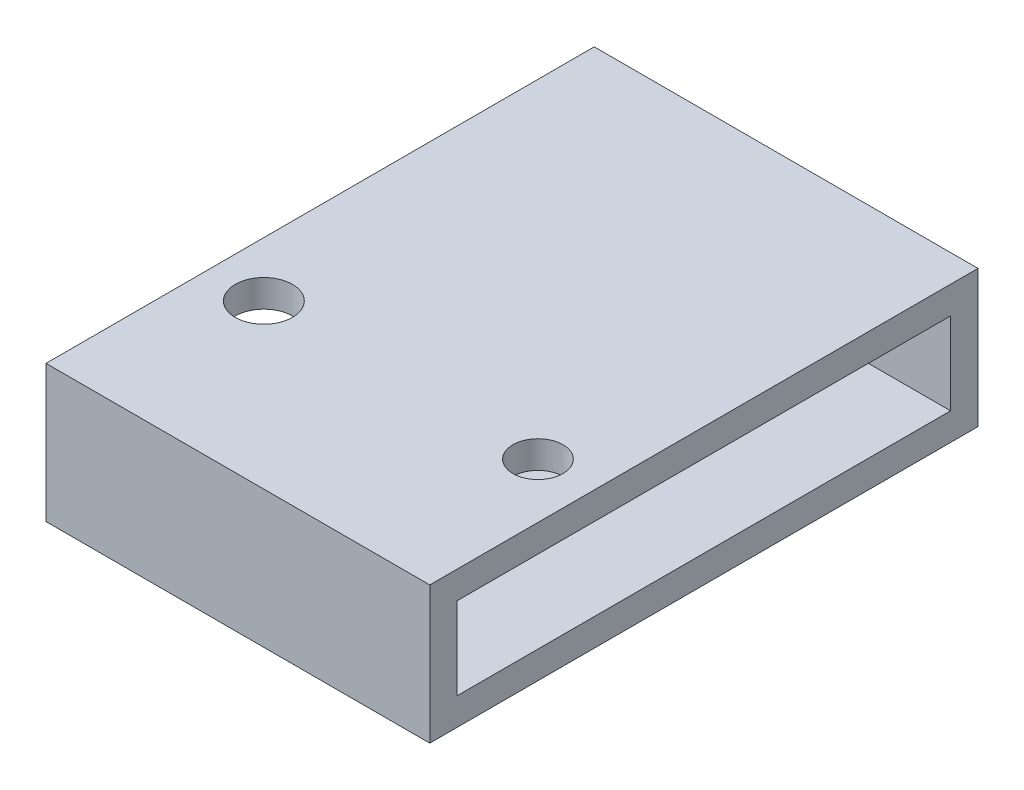
ISO-10303-21;
HEADER;
FILE_DESCRIPTION(('STEP AP214'),'2;1');
FILE_NAME('part.step','',(''),(''),'','','');
FILE_SCHEMA(('AUTOMOTIVE_DESIGN { 1 0 10303 214 1 1 1 1 }'));
ENDSEC;
DATA;
#1=APPLICATION_CONTEXT('core data for automotive mechanical design processes');
#2=APPLICATION_PROTOCOL_DEFINITION('international standard','automotive_design',2000,#1);
#3=PRODUCT_CONTEXT('',#1,'mechanical');
#4=PRODUCT('Part','Part','',(#3));
#5=PRODUCT_RELATED_PRODUCT_CATEGORY('part','',(#4));
#6=PRODUCT_DEFINITION_FORMATION('','',#4);
#7=PRODUCT_DEFINITION_CONTEXT('part definition',#1,'design');
#8=PRODUCT_DEFINITION('design','',#6,#7);
#9=PRODUCT_DEFINITION_SHAPE('','',#8);
#10=(LENGTH_UNIT() NAMED_UNIT(*) SI_UNIT(.MILLI.,.METRE.));
#11=(NAMED_UNIT(*) PLANE_ANGLE_UNIT() SI_UNIT($,.RADIAN.));
#12=(NAMED_UNIT(*) SI_UNIT($,.STERADIAN.) SOLID_ANGLE_UNIT());
#13=UNCERTAINTY_MEASURE_WITH_UNIT(LENGTH_MEASURE(1.E-05),#10,'distance_accuracy_value','');
#14=(GEOMETRIC_REPRESENTATION_CONTEXT(3) GLOBAL_UNCERTAINTY_ASSIGNED_CONTEXT((#13)) GLOBAL_UNIT_ASSIGNED_CONTEXT((#10,
#11,#12)) REPRESENTATION_CONTEXT('',''));
#15=CARTESIAN_POINT('',(0.,0.,0.));
#16=DIRECTION('',(0.,0.,1.));
#17=DIRECTION('',(1.,0.,0.));
#18=AXIS2_PLACEMENT_3D('',#15,#16,#17);
#19=CARTESIAN_POINT('',(0.,6.35,0.));
#20=DIRECTION('',(1.,0.,0.));
#21=DIRECTION('',(0.,0.,-1.));
#22=AXIS2_PLACEMENT_3D('',#19,#20,#21);
#23=PLANE('',#22);
#24=DIRECTION('',(0.,1.,0.));
#25=VECTOR('',#24,1.);
#26=CARTESIAN_POINT('',(0.,5.08,-1.27));
#27=LINE('',#26,#25);
#28=CARTESIAN_POINT('',(0.,1.27,-1.27));
#29=VERTEX_POINT('',#28);
#30=CARTESIAN_POINT('',(0.,5.08,-1.27));
#31=VERTEX_POINT('',#30);
#32=EDGE_CURVE('E55',#29,#31,#27,.T.);
#33=ORIENTED_EDGE('',*,*,#32,.F.);
#34=DIRECTION('',(0.,0.,1.));
#35=VECTOR('',#34,1.);
#36=CARTESIAN_POINT('',(0.,1.27,-1.27));
#37=LINE('',#36,#35);
#38=CARTESIAN_POINT('',(0.,1.27,-24.13));
#39=VERTEX_POINT('',#38);
#40=EDGE_CURVE('E109',#39,#29,#37,.T.);
#41=ORIENTED_EDGE('',*,*,#40,.F.);
#42=DIRECTION('',(0.,-1.,0.));
#43=VECTOR('',#42,1.);
#44=CARTESIAN_POINT('',(0.,1.27,-24.13));
#45=LINE('',#44,#43);
#46=CARTESIAN_POINT('',(0.,5.08,-24.13));
#47=VERTEX_POINT('',#46);
#48=EDGE_CURVE('E116',#47,#39,#45,.T.);
#49=ORIENTED_EDGE('',*,*,#48,.F.);
#50=DIRECTION('',(0.,0.,-1.));
#51=VECTOR('',#50,1.);
#52=CARTESIAN_POINT('',(0.,5.08,-24.13));
#53=LINE('',#52,#51);
#54=EDGE_CURVE('E127',#31,#47,#53,.T.);
#55=ORIENTED_EDGE('',*,*,#54,.F.);
#56=EDGE_LOOP('',(#33,#41,#49,#55));
#57=FACE_BOUND('',#56,.T.);
#58=DIRECTION('',(0.,0.,1.));
#59=VECTOR('',#58,1.);
#60=CARTESIAN_POINT('',(0.,0.,0.));
#61=LINE('',#60,#59);
#62=CARTESIAN_POINT('',(0.,0.,-25.4));
#63=VERTEX_POINT('',#62);
#64=CARTESIAN_POINT('',(0.,0.,0.));
#65=VERTEX_POINT('',#64);
#66=EDGE_CURVE('E150',#63,#65,#61,.T.);
#67=ORIENTED_EDGE('',*,*,#66,.T.);
#68=DIRECTION('',(0.,-1.,0.));
#69=VECTOR('',#68,1.);
#70=CARTESIAN_POINT('',(0.,6.35,0.));
#71=LINE('',#70,#69);
#72=CARTESIAN_POINT('',(0.,6.35,0.));
#73=VERTEX_POINT('',#72);
#74=EDGE_CURVE('E11',#73,#65,#71,.T.);
#75=ORIENTED_EDGE('',*,*,#74,.F.);
#76=DIRECTION('',(0.,0.,1.));
#77=VECTOR('',#76,1.);
#78=CARTESIAN_POINT('',(0.,6.35,0.));
#79=LINE('',#78,#77);
#80=CARTESIAN_POINT('',(0.,6.35,-25.4));
#81=VERTEX_POINT('',#80);
#82=EDGE_CURVE('E153',#81,#73,#79,.T.);
#83=ORIENTED_EDGE('',*,*,#82,.F.);
#84=DIRECTION('',(0.,-1.,0.));
#85=VECTOR('',#84,1.);
#86=CARTESIAN_POINT('',(0.,6.35,-25.4));
#87=LINE('',#86,#85);
#88=EDGE_CURVE('E163',#81,#63,#87,.T.);
#89=ORIENTED_EDGE('',*,*,#88,.T.);
#90=EDGE_LOOP('',(#67,#75,#83,#89));
#91=FACE_BOUND('',#90,.T.);
#92=ADVANCED_FACE('F41',(#57,#91),#23,.F.);
#93=CARTESIAN_POINT('',(0.,6.35,0.));
#94=DIRECTION('',(0.,0.,-1.));
#95=DIRECTION('',(-1.,0.,0.));
#96=AXIS2_PLACEMENT_3D('',#93,#94,#95);
#97=PLANE('',#96);
#98=DIRECTION('',(1.,0.,0.));
#99=VECTOR('',#98,1.);
#100=CARTESIAN_POINT('',(0.,0.,0.));
#101=LINE('',#100,#99);
#102=CARTESIAN_POINT('',(17.78,0.,0.));
#103=VERTEX_POINT('',#102);
#104=EDGE_CURVE('E166',#65,#103,#101,.T.);
#105=ORIENTED_EDGE('',*,*,#104,.T.);
#106=DIRECTION('',(0.,-1.,0.));
#107=VECTOR('',#106,1.);
#108=CARTESIAN_POINT('',(17.78,6.35,0.));
#109=LINE('',#108,#107);
#110=CARTESIAN_POINT('',(17.78,6.35,0.));
#111=VERTEX_POINT('',#110);
#112=EDGE_CURVE('E48',#111,#103,#109,.T.);
#113=ORIENTED_EDGE('',*,*,#112,.F.);
#114=DIRECTION('',(1.,0.,0.));
#115=VECTOR('',#114,1.);
#116=CARTESIAN_POINT('',(0.,6.35,0.));
#117=LINE('',#116,#115);
#118=EDGE_CURVE('E156',#73,#111,#117,.T.);
#119=ORIENTED_EDGE('',*,*,#118,.F.);
#120=ORIENTED_EDGE('',*,*,#74,.T.);
#121=EDGE_LOOP('',(#105,#113,#119,#120));
#122=FACE_BOUND('',#121,.T.);
#123=ADVANCED_FACE('F195',(#122),#97,.F.);
#124=CARTESIAN_POINT('',(17.78,6.35,0.));
#125=DIRECTION('',(-1.,0.,0.));
#126=DIRECTION('',(0.,0.,1.));
#127=AXIS2_PLACEMENT_3D('',#124,#125,#126);
#128=PLANE('',#127);
#129=DIRECTION('',(0.,1.,0.));
#130=VECTOR('',#129,1.);
#131=CARTESIAN_POINT('',(17.78,1.27,-24.13));
#132=LINE('',#131,#130);
#133=CARTESIAN_POINT('',(17.78,1.27,-24.13));
#134=VERTEX_POINT('',#133);
#135=CARTESIAN_POINT('',(17.78,5.08,-24.13));
#136=VERTEX_POINT('',#135);
#137=EDGE_CURVE('E63',#134,#136,#132,.T.);
#138=ORIENTED_EDGE('',*,*,#137,.F.);
#139=DIRECTION('',(0.,0.,-1.));
#140=VECTOR('',#139,1.);
#141=CARTESIAN_POINT('',(17.78,1.27,-1.27));
#142=LINE('',#141,#140);
#143=CARTESIAN_POINT('',(17.78,1.27,-1.27));
#144=VERTEX_POINT('',#143);
#145=EDGE_CURVE('E111',#144,#134,#142,.T.);
#146=ORIENTED_EDGE('',*,*,#145,.F.);
#147=DIRECTION('',(0.,-1.,0.));
#148=VECTOR('',#147,1.);
#149=CARTESIAN_POINT('',(17.78,5.08,-1.27));
#150=LINE('',#149,#148);
#151=CARTESIAN_POINT('',(17.78,5.08,-1.27));
#152=VERTEX_POINT('',#151);
#153=EDGE_CURVE('E113',#152,#144,#150,.T.);
#154=ORIENTED_EDGE('',*,*,#153,.F.);
#155=DIRECTION('',(0.,0.,1.));
#156=VECTOR('',#155,1.);
#157=CARTESIAN_POINT('',(17.78,5.08,-24.13));
#158=LINE('',#157,#156);
#159=EDGE_CURVE('E132',#136,#152,#158,.T.);
#160=ORIENTED_EDGE('',*,*,#159,.F.);
#161=EDGE_LOOP('',(#138,#146,#154,#160));
#162=FACE_BOUND('',#161,.T.);
#163=DIRECTION('',(0.,0.,-1.));
#164=VECTOR('',#163,1.);
#165=CARTESIAN_POINT('',(17.78,0.,0.));
#166=LINE('',#165,#164);
#167=CARTESIAN_POINT('',(17.78,0.,-25.4));
#168=VERTEX_POINT('',#167);
#169=EDGE_CURVE('E168',#103,#168,#166,.T.);
#170=ORIENTED_EDGE('',*,*,#169,.T.);
#171=DIRECTION('',(0.,-1.,0.));
#172=VECTOR('',#171,1.);
#173=CARTESIAN_POINT('',(17.78,6.35,-25.4));
#174=LINE('',#173,#172);
#175=CARTESIAN_POINT('',(17.78,6.35,-25.4));
#176=VERTEX_POINT('',#175);
#177=EDGE_CURVE('E173',#176,#168,#174,.T.);
#178=ORIENTED_EDGE('',*,*,#177,.F.);
#179=DIRECTION('',(0.,0.,-1.));
#180=VECTOR('',#179,1.);
#181=CARTESIAN_POINT('',(17.78,6.35,0.));
#182=LINE('',#181,#180);
#183=EDGE_CURVE('E159',#111,#176,#182,.T.);
#184=ORIENTED_EDGE('',*,*,#183,.F.);
#185=ORIENTED_EDGE('',*,*,#112,.T.);
#186=EDGE_LOOP('',(#170,#178,#184,#185));
#187=FACE_BOUND('',#186,.T.);
#188=ADVANCED_FACE('F180',(#162,#187),#128,.F.);
#189=CARTESIAN_POINT('',(0.,6.35,-25.4));
#190=DIRECTION('',(0.,0.,1.));
#191=DIRECTION('',(1.,0.,0.));
#192=AXIS2_PLACEMENT_3D('',#189,#190,#191);
#193=PLANE('',#192);
#194=DIRECTION('',(-1.,0.,0.));
#195=VECTOR('',#194,1.);
#196=CARTESIAN_POINT('',(0.,0.,-25.4));
#197=LINE('',#196,#195);
#198=EDGE_CURVE('E157',#168,#63,#197,.T.);
#199=ORIENTED_EDGE('',*,*,#198,.T.);
#200=ORIENTED_EDGE('',*,*,#88,.F.);
#201=DIRECTION('',(-1.,0.,0.));
#202=VECTOR('',#201,1.);
#203=CARTESIAN_POINT('',(0.,6.35,-25.4));
#204=LINE('',#203,#202);
#205=EDGE_CURVE('E161',#176,#81,#204,.T.);
#206=ORIENTED_EDGE('',*,*,#205,.F.);
#207=ORIENTED_EDGE('',*,*,#177,.T.);
#208=EDGE_LOOP('',(#199,#200,#206,#207));
#209=FACE_BOUND('',#208,.T.);
#210=ADVANCED_FACE('F189',(#209),#193,.F.);
#211=CARTESIAN_POINT('',(0.,6.35,0.));
#212=DIRECTION('',(0.,-1.,0.));
#213=DIRECTION('',(0.,0.,-1.));
#214=AXIS2_PLACEMENT_3D('',#211,#212,#213);
#215=PLANE('',#214);
#216=CARTESIAN_POINT('',(2.54,6.35,-7.55293748661177));
#217=DIRECTION('',(0.,1.,0.));
#218=DIRECTION('',(0.,0.,1.));
#219=AXIS2_PLACEMENT_3D('',#216,#217,#218);
#220=CIRCLE('',#219,1.32608505778554);
#221=CARTESIAN_POINT('',(2.54,6.35,-6.22685242882622));
#222=VERTEX_POINT('',#221);
#223=EDGE_CURVE('E147',#222,#222,#220,.T.);
#224=ORIENTED_EDGE('',*,*,#223,.F.);
#225=EDGE_LOOP('',(#224));
#226=FACE_BOUND('',#225,.T.);
#227=CARTESIAN_POINT('',(15.24,6.35,-7.55293748661177));
#228=DIRECTION('',(0.,1.,0.));
#229=DIRECTION('',(0.,0.,1.));
#230=AXIS2_PLACEMENT_3D('',#227,#228,#229);
#231=CIRCLE('',#230,1.15915432908554);
#232=CARTESIAN_POINT('',(15.24,6.35,-6.39378315752623));
#233=VERTEX_POINT('',#232);
#234=EDGE_CURVE('E146',#233,#233,#231,.T.);
#235=ORIENTED_EDGE('',*,*,#234,.F.);
#236=EDGE_LOOP('',(#235));
#237=FACE_BOUND('',#236,.T.);
#238=ORIENTED_EDGE('',*,*,#82,.T.);
#239=ORIENTED_EDGE('',*,*,#118,.T.);
#240=ORIENTED_EDGE('',*,*,#183,.T.);
#241=ORIENTED_EDGE('',*,*,#205,.T.);
#242=EDGE_LOOP('',(#238,#239,#240,#241));
#243=FACE_BOUND('',#242,.T.);
#244=ADVANCED_FACE('F194',(#226,#237,#243),#215,.F.);
#245=CARTESIAN_POINT('',(0.,0.,0.));
#246=DIRECTION('',(0.,-1.,0.));
#247=DIRECTION('',(0.,0.,-1.));
#248=AXIS2_PLACEMENT_3D('',#245,#246,#247);
#249=PLANE('',#248);
#250=ORIENTED_EDGE('',*,*,#66,.F.);
#251=ORIENTED_EDGE('',*,*,#198,.F.);
#252=ORIENTED_EDGE('',*,*,#169,.F.);
#253=ORIENTED_EDGE('',*,*,#104,.F.);
#254=EDGE_LOOP('',(#250,#251,#252,#253));
#255=FACE_BOUND('',#254,.T.);
#256=ADVANCED_FACE('F186',(#255),#249,.T.);
#257=CARTESIAN_POINT('',(15.24,2.54,-7.55293748661177));
#258=DIRECTION('',(0.,1.,0.));
#259=DIRECTION('',(0.,0.,1.));
#260=AXIS2_PLACEMENT_3D('',#257,#258,#259);
#261=CYLINDRICAL_SURFACE('',#260,1.15915432908554);
#262=CARTESIAN_POINT('',(15.24,5.08,-7.55293748661177));
#263=DIRECTION('',(0.,1.,0.));
#264=DIRECTION('',(0.,0.,1.));
#265=AXIS2_PLACEMENT_3D('',#262,#263,#264);
#266=CIRCLE('',#265,1.15915432908554);
#267=CARTESIAN_POINT('',(15.24,5.08,-6.39378315752623));
#268=VERTEX_POINT('',#267);
#269=EDGE_CURVE('E143',#268,#268,#266,.T.);
#270=ORIENTED_EDGE('',*,*,#269,.F.);
#271=EDGE_LOOP('',(#270));
#272=FACE_BOUND('',#271,.T.);
#273=ORIENTED_EDGE('',*,*,#234,.T.);
#274=EDGE_LOOP('',(#273));
#275=FACE_BOUND('',#274,.T.);
#276=ADVANCED_FACE('F208',(#272,#275),#261,.F.);
#277=CARTESIAN_POINT('',(2.54,2.54,-7.55293748661177));
#278=DIRECTION('',(0.,1.,0.));
#279=DIRECTION('',(0.,0.,1.));
#280=AXIS2_PLACEMENT_3D('',#277,#278,#279);
#281=CYLINDRICAL_SURFACE('',#280,1.32608505778554);
#282=CARTESIAN_POINT('',(2.54,5.08,-7.55293748661177));
#283=DIRECTION('',(0.,1.,0.));
#284=DIRECTION('',(0.,0.,1.));
#285=AXIS2_PLACEMENT_3D('',#282,#283,#284);
#286=CIRCLE('',#285,1.32608505778554);
#287=CARTESIAN_POINT('',(2.54,5.08,-6.22685242882622));
#288=VERTEX_POINT('',#287);
#289=EDGE_CURVE('E121',#288,#288,#286,.T.);
#290=ORIENTED_EDGE('',*,*,#289,.F.);
#291=EDGE_LOOP('',(#290));
#292=FACE_BOUND('',#291,.T.);
#293=ORIENTED_EDGE('',*,*,#223,.T.);
#294=EDGE_LOOP('',(#293));
#295=FACE_BOUND('',#294,.T.);
#296=ADVANCED_FACE('F214',(#292,#295),#281,.F.);
#297=CARTESIAN_POINT('',(-0.001000000000001,1.27,-1.27));
#298=DIRECTION('',(0.,-1.,0.));
#299=DIRECTION('',(0.,0.,-1.));
#300=AXIS2_PLACEMENT_3D('',#297,#298,#299);
#301=PLANE('',#300);
#302=ORIENTED_EDGE('',*,*,#40,.T.);
#303=DIRECTION('',(1.,0.,0.));
#304=VECTOR('',#303,1.);
#305=CARTESIAN_POINT('',(-0.001000000000001,1.27,-1.27));
#306=LINE('',#305,#304);
#307=EDGE_CURVE('E122',#29,#144,#306,.T.);
#308=ORIENTED_EDGE('',*,*,#307,.T.);
#309=ORIENTED_EDGE('',*,*,#145,.T.);
#310=DIRECTION('',(1.,0.,0.));
#311=VECTOR('',#310,1.);
#312=CARTESIAN_POINT('',(-0.001000000000001,1.27,-24.13));
#313=LINE('',#312,#311);
#314=EDGE_CURVE('E105',#39,#134,#313,.T.);
#315=ORIENTED_EDGE('',*,*,#314,.F.);
#316=EDGE_LOOP('',(#302,#308,#309,#315));
#317=FACE_BOUND('',#316,.T.);
#318=ADVANCED_FACE('F107',(#317),#301,.F.);
#319=CARTESIAN_POINT('',(-0.001000000000001,5.08,-1.27));
#320=DIRECTION('',(0.,0.,1.));
#321=DIRECTION('',(1.,0.,0.));
#322=AXIS2_PLACEMENT_3D('',#319,#320,#321);
#323=PLANE('',#322);
#324=ORIENTED_EDGE('',*,*,#32,.T.);
#325=DIRECTION('',(1.,0.,0.));
#326=VECTOR('',#325,1.);
#327=CARTESIAN_POINT('',(-0.001000000000001,5.08,-1.27));
#328=LINE('',#327,#326);
#329=EDGE_CURVE('E138',#31,#152,#328,.T.);
#330=ORIENTED_EDGE('',*,*,#329,.T.);
#331=ORIENTED_EDGE('',*,*,#153,.T.);
#332=ORIENTED_EDGE('',*,*,#307,.F.);
#333=EDGE_LOOP('',(#324,#330,#331,#332));
#334=FACE_BOUND('',#333,.T.);
#335=ADVANCED_FACE('F221',(#334),#323,.F.);
#336=CARTESIAN_POINT('',(-0.001000000000001,1.27,-24.13));
#337=DIRECTION('',(0.,0.,-1.));
#338=DIRECTION('',(-1.,0.,0.));
#339=AXIS2_PLACEMENT_3D('',#336,#337,#338);
#340=PLANE('',#339);
#341=ORIENTED_EDGE('',*,*,#48,.T.);
#342=ORIENTED_EDGE('',*,*,#314,.T.);
#343=ORIENTED_EDGE('',*,*,#137,.T.);
#344=DIRECTION('',(1.,0.,0.));
#345=VECTOR('',#344,1.);
#346=CARTESIAN_POINT('',(-0.001000000000001,5.08,-24.13));
#347=LINE('',#346,#345);
#348=EDGE_CURVE('E112',#47,#136,#347,.T.);
#349=ORIENTED_EDGE('',*,*,#348,.F.);
#350=EDGE_LOOP('',(#341,#342,#343,#349));
#351=FACE_BOUND('',#350,.T.);
#352=ADVANCED_FACE('F117',(#351),#340,.F.);
#353=CARTESIAN_POINT('',(-0.001000000000001,5.08,-24.13));
#354=DIRECTION('',(0.,1.,0.));
#355=DIRECTION('',(0.,0.,1.));
#356=AXIS2_PLACEMENT_3D('',#353,#354,#355);
#357=PLANE('',#356);
#358=ORIENTED_EDGE('',*,*,#54,.T.);
#359=ORIENTED_EDGE('',*,*,#348,.T.);
#360=ORIENTED_EDGE('',*,*,#159,.T.);
#361=ORIENTED_EDGE('',*,*,#329,.F.);
#362=EDGE_LOOP('',(#358,#359,#360,#361));
#363=FACE_BOUND('',#362,.T.);
#364=ORIENTED_EDGE('',*,*,#269,.T.);
#365=EDGE_LOOP('',(#364));
#366=FACE_BOUND('',#365,.T.);
#367=ORIENTED_EDGE('',*,*,#289,.T.);
#368=EDGE_LOOP('',(#367));
#369=FACE_BOUND('',#368,.T.);
#370=ADVANCED_FACE('F224',(#363,#366,#369),#357,.F.);
#371=CLOSED_SHELL('',(#92,#123,#188,#210,#244,#256,#276,#296,#318,#335,#352,#370));
#372=MANIFOLD_SOLID_BREP('B2',#371);
#373=ADVANCED_BREP_SHAPE_REPRESENTATION('',(#18,#372),#14);
#374=SHAPE_DEFINITION_REPRESENTATION(#9,#373);
ENDSEC;
END-ISO-10303-21;
